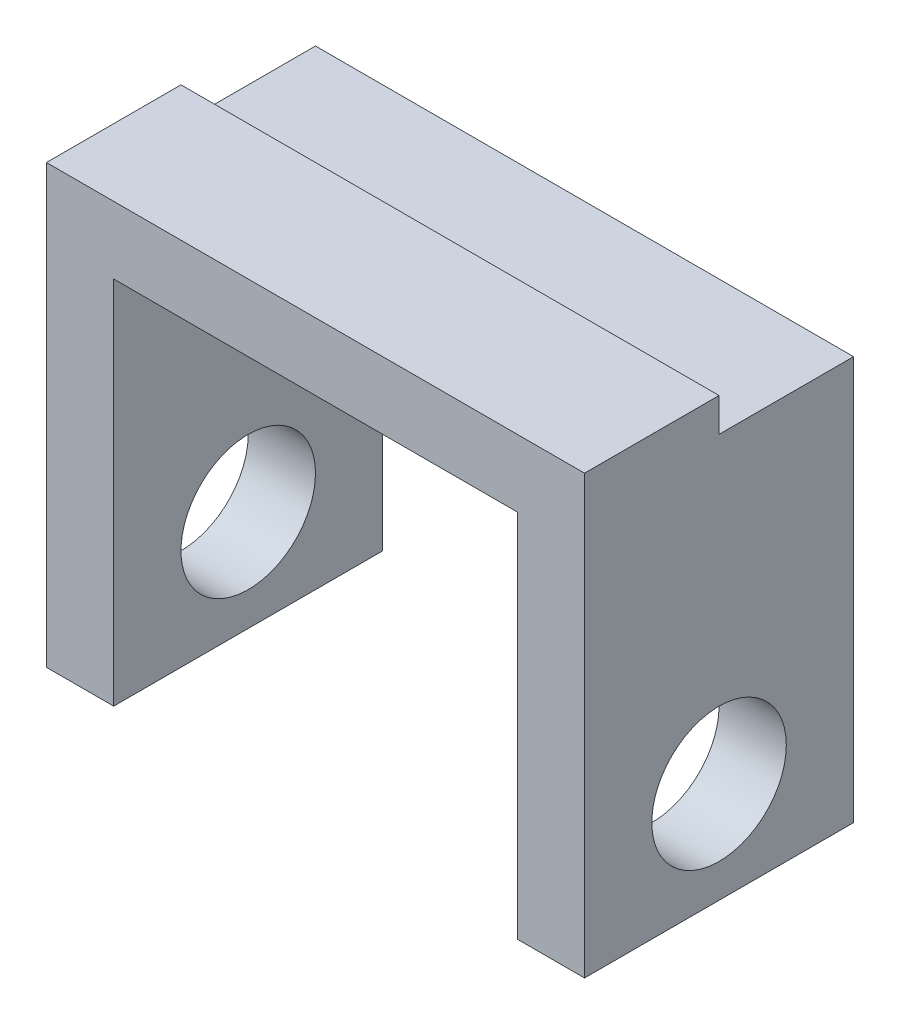
ISO-10303-21;
HEADER;
FILE_DESCRIPTION(('STEP AP214'),'2;1');
FILE_NAME('part.step','',(''),(''),'','','');
FILE_SCHEMA(('AUTOMOTIVE_DESIGN { 1 0 10303 214 1 1 1 1 }'));
ENDSEC;
DATA;
#1=APPLICATION_CONTEXT('core data for automotive mechanical design processes');
#2=APPLICATION_PROTOCOL_DEFINITION('international standard','automotive_design',2000,#1);
#3=PRODUCT_CONTEXT('',#1,'mechanical');
#4=PRODUCT('Part','Part','',(#3));
#5=PRODUCT_RELATED_PRODUCT_CATEGORY('part','',(#4));
#6=PRODUCT_DEFINITION_FORMATION('','',#4);
#7=PRODUCT_DEFINITION_CONTEXT('part definition',#1,'design');
#8=PRODUCT_DEFINITION('design','',#6,#7);
#9=PRODUCT_DEFINITION_SHAPE('','',#8);
#10=(LENGTH_UNIT() NAMED_UNIT(*) SI_UNIT(.MILLI.,.METRE.));
#11=(NAMED_UNIT(*) PLANE_ANGLE_UNIT() SI_UNIT($,.RADIAN.));
#12=(NAMED_UNIT(*) SI_UNIT($,.STERADIAN.) SOLID_ANGLE_UNIT());
#13=UNCERTAINTY_MEASURE_WITH_UNIT(LENGTH_MEASURE(1.E-05),#10,'distance_accuracy_value','');
#14=(GEOMETRIC_REPRESENTATION_CONTEXT(3) GLOBAL_UNCERTAINTY_ASSIGNED_CONTEXT((#13)) GLOBAL_UNIT_ASSIGNED_CONTEXT((#10,
#11,#12)) REPRESENTATION_CONTEXT('',''));
#15=CARTESIAN_POINT('',(0.,0.,0.));
#16=DIRECTION('',(0.,0.,1.));
#17=DIRECTION('',(1.,0.,0.));
#18=AXIS2_PLACEMENT_3D('',#15,#16,#17);
#19=CARTESIAN_POINT('',(40.,50.,20.));
#20=DIRECTION('',(0.,0.,-1.));
#21=DIRECTION('',(0.,1.,0.));
#22=AXIS2_PLACEMENT_3D('',#19,#20,#21);
#23=PLANE('',#22);
#24=DIRECTION('',(0.,1.,0.));
#25=VECTOR('',#24,1.);
#26=CARTESIAN_POINT('',(-30.,-15.,20.));
#27=LINE('',#26,#25);
#28=CARTESIAN_POINT('',(-30.,-15.,20.));
#29=VERTEX_POINT('',#28);
#30=CARTESIAN_POINT('',(-30.,40.,20.));
#31=VERTEX_POINT('',#30);
#32=EDGE_CURVE('E137',#29,#31,#27,.T.);
#33=ORIENTED_EDGE('',*,*,#32,.T.);
#34=DIRECTION('',(1.,0.,0.));
#35=VECTOR('',#34,1.);
#36=CARTESIAN_POINT('',(-30.,40.,20.));
#37=LINE('',#36,#35);
#38=CARTESIAN_POINT('',(30.,40.,20.));
#39=VERTEX_POINT('',#38);
#40=EDGE_CURVE('E141',#31,#39,#37,.T.);
#41=ORIENTED_EDGE('',*,*,#40,.T.);
#42=DIRECTION('',(0.,1.,0.));
#43=VECTOR('',#42,1.);
#44=CARTESIAN_POINT('',(30.,-15.,20.));
#45=LINE('',#44,#43);
#46=CARTESIAN_POINT('',(30.,-15.,20.));
#47=VERTEX_POINT('',#46);
#48=EDGE_CURVE('E144',#47,#39,#45,.T.);
#49=ORIENTED_EDGE('',*,*,#48,.F.);
#50=DIRECTION('',(-1.,0.,0.));
#51=VECTOR('',#50,1.);
#52=CARTESIAN_POINT('',(40.,-15.,20.));
#53=LINE('',#52,#51);
#54=CARTESIAN_POINT('',(40.,-15.,20.));
#55=VERTEX_POINT('',#54);
#56=EDGE_CURVE('E11',#55,#47,#53,.T.);
#57=ORIENTED_EDGE('',*,*,#56,.F.);
#58=DIRECTION('',(0.,-1.,0.));
#59=VECTOR('',#58,1.);
#60=CARTESIAN_POINT('',(40.,50.,20.));
#61=LINE('',#60,#59);
#62=CARTESIAN_POINT('',(40.,50.,20.));
#63=VERTEX_POINT('',#62);
#64=EDGE_CURVE('E169',#63,#55,#61,.T.);
#65=ORIENTED_EDGE('',*,*,#64,.F.);
#66=DIRECTION('',(-1.,0.,0.));
#67=VECTOR('',#66,1.);
#68=CARTESIAN_POINT('',(40.,50.,20.));
#69=LINE('',#68,#67);
#70=CARTESIAN_POINT('',(-40.,50.,20.));
#71=VERTEX_POINT('',#70);
#72=EDGE_CURVE('E178',#63,#71,#69,.T.);
#73=ORIENTED_EDGE('',*,*,#72,.T.);
#74=DIRECTION('',(0.,-1.,0.));
#75=VECTOR('',#74,1.);
#76=CARTESIAN_POINT('',(-40.,50.,20.));
#77=LINE('',#76,#75);
#78=CARTESIAN_POINT('',(-40.,-15.,20.));
#79=VERTEX_POINT('',#78);
#80=EDGE_CURVE('E165',#71,#79,#77,.T.);
#81=ORIENTED_EDGE('',*,*,#80,.T.);
#82=EDGE_CURVE('E41',#29,#79,#53,.T.);
#83=ORIENTED_EDGE('',*,*,#82,.F.);
#84=EDGE_LOOP('',(#33,#41,#49,#57,#65,#73,#81,#83));
#85=FACE_BOUND('',#84,.T.);
#86=ADVANCED_FACE('F33',(#85),#23,.F.);
#87=CARTESIAN_POINT('',(40.,-15.,20.));
#88=DIRECTION('',(0.,1.,0.));
#89=DIRECTION('',(0.,0.,1.));
#90=AXIS2_PLACEMENT_3D('',#87,#88,#89);
#91=PLANE('',#90);
#92=DIRECTION('',(0.,0.,1.));
#93=VECTOR('',#92,1.);
#94=CARTESIAN_POINT('',(-30.,-15.,-20.));
#95=LINE('',#94,#93);
#96=CARTESIAN_POINT('',(-30.,-15.,-20.));
#97=VERTEX_POINT('',#96);
#98=EDGE_CURVE('E153',#97,#29,#95,.T.);
#99=ORIENTED_EDGE('',*,*,#98,.T.);
#100=ORIENTED_EDGE('',*,*,#82,.T.);
#101=DIRECTION('',(0.,0.,-1.));
#102=VECTOR('',#101,1.);
#103=CARTESIAN_POINT('',(-40.,-15.,20.));
#104=LINE('',#103,#102);
#105=CARTESIAN_POINT('',(-40.,-15.,-20.));
#106=VERTEX_POINT('',#105);
#107=EDGE_CURVE('E181',#79,#106,#104,.T.);
#108=ORIENTED_EDGE('',*,*,#107,.T.);
#109=DIRECTION('',(-1.,0.,0.));
#110=VECTOR('',#109,1.);
#111=CARTESIAN_POINT('',(40.,-15.,-20.));
#112=LINE('',#111,#110);
#113=EDGE_CURVE('E190',#97,#106,#112,.T.);
#114=ORIENTED_EDGE('',*,*,#113,.F.);
#115=EDGE_LOOP('',(#99,#100,#108,#114));
#116=FACE_BOUND('',#115,.T.);
#117=ADVANCED_FACE('F215',(#116),#91,.F.);
#118=CARTESIAN_POINT('',(40.,50.,-20.));
#119=DIRECTION('',(0.,0.,1.));
#120=DIRECTION('',(0.,-1.,0.));
#121=AXIS2_PLACEMENT_3D('',#118,#119,#120);
#122=PLANE('',#121);
#123=DIRECTION('',(0.,1.,0.));
#124=VECTOR('',#123,1.);
#125=CARTESIAN_POINT('',(-40.,50.,-20.));
#126=LINE('',#125,#124);
#127=CARTESIAN_POINT('',(-40.,45.,-20.));
#128=VERTEX_POINT('',#127);
#129=EDGE_CURVE('E184',#106,#128,#126,.T.);
#130=ORIENTED_EDGE('',*,*,#129,.T.);
#131=DIRECTION('',(1.,0.,0.));
#132=VECTOR('',#131,1.);
#133=CARTESIAN_POINT('',(-40.,45.,-20.));
#134=LINE('',#133,#132);
#135=CARTESIAN_POINT('',(40.,45.,-20.));
#136=VERTEX_POINT('',#135);
#137=EDGE_CURVE('E118',#128,#136,#134,.T.);
#138=ORIENTED_EDGE('',*,*,#137,.T.);
#139=DIRECTION('',(0.,1.,0.));
#140=VECTOR('',#139,1.);
#141=CARTESIAN_POINT('',(40.,50.,-20.));
#142=LINE('',#141,#140);
#143=CARTESIAN_POINT('',(40.,-15.,-20.));
#144=VERTEX_POINT('',#143);
#145=EDGE_CURVE('E131',#144,#136,#142,.T.);
#146=ORIENTED_EDGE('',*,*,#145,.F.);
#147=CARTESIAN_POINT('',(30.,-15.,-20.));
#148=VERTEX_POINT('',#147);
#149=EDGE_CURVE('E191',#144,#148,#112,.T.);
#150=ORIENTED_EDGE('',*,*,#149,.T.);
#151=DIRECTION('',(0.,1.,0.));
#152=VECTOR('',#151,1.);
#153=CARTESIAN_POINT('',(30.,-15.,-20.));
#154=LINE('',#153,#152);
#155=CARTESIAN_POINT('',(30.,40.,-20.));
#156=VERTEX_POINT('',#155);
#157=EDGE_CURVE('E150',#148,#156,#154,.T.);
#158=ORIENTED_EDGE('',*,*,#157,.T.);
#159=DIRECTION('',(1.,0.,0.));
#160=VECTOR('',#159,1.);
#161=CARTESIAN_POINT('',(-30.,40.,-20.));
#162=LINE('',#161,#160);
#163=CARTESIAN_POINT('',(-30.,40.,-20.));
#164=VERTEX_POINT('',#163);
#165=EDGE_CURVE('E148',#164,#156,#162,.T.);
#166=ORIENTED_EDGE('',*,*,#165,.F.);
#167=DIRECTION('',(0.,1.,0.));
#168=VECTOR('',#167,1.);
#169=CARTESIAN_POINT('',(-30.,-15.,-20.));
#170=LINE('',#169,#168);
#171=EDGE_CURVE('E146',#97,#164,#170,.T.);
#172=ORIENTED_EDGE('',*,*,#171,.F.);
#173=ORIENTED_EDGE('',*,*,#113,.T.);
#174=EDGE_LOOP('',(#130,#138,#146,#150,#158,#166,#172,#173));
#175=FACE_BOUND('',#174,.T.);
#176=ADVANCED_FACE('F214',(#175),#122,.F.);
#177=CARTESIAN_POINT('',(40.,0.,0.));
#178=DIRECTION('',(-1.,0.,0.));
#179=DIRECTION('',(0.,0.,1.));
#180=AXIS2_PLACEMENT_3D('',#177,#178,#179);
#181=CYLINDRICAL_SURFACE('',#180,10.);
#182=CARTESIAN_POINT('',(-40.,0.,0.));
#183=DIRECTION('',(1.,0.,0.));
#184=DIRECTION('',(0.,0.,-1.));
#185=AXIS2_PLACEMENT_3D('',#182,#183,#184);
#186=CIRCLE('',#185,10.);
#187=CARTESIAN_POINT('',(-40.,0.,-10.));
#188=VERTEX_POINT('',#187);
#189=EDGE_CURVE('E166',#188,#188,#186,.T.);
#190=ORIENTED_EDGE('',*,*,#189,.F.);
#191=EDGE_LOOP('',(#190));
#192=FACE_BOUND('',#191,.T.);
#193=CARTESIAN_POINT('',(-30.,0.,0.));
#194=DIRECTION('',(1.,0.,0.));
#195=DIRECTION('',(0.,0.,-1.));
#196=AXIS2_PLACEMENT_3D('',#193,#194,#195);
#197=CIRCLE('',#196,10.);
#198=CARTESIAN_POINT('',(-30.,0.,-10.));
#199=VERTEX_POINT('',#198);
#200=EDGE_CURVE('E36',#199,#199,#197,.T.);
#201=ORIENTED_EDGE('',*,*,#200,.T.);
#202=EDGE_LOOP('',(#201));
#203=FACE_BOUND('',#202,.T.);
#204=ADVANCED_FACE('F199',(#192,#203),#181,.F.);
#205=CARTESIAN_POINT('',(40.,0.,0.));
#206=DIRECTION('',(1.,0.,0.));
#207=DIRECTION('',(0.,0.,-1.));
#208=AXIS2_PLACEMENT_3D('',#205,#206,#207);
#209=PLANE('',#208);
#210=DIRECTION('',(0.,-1.,0.));
#211=VECTOR('',#210,1.);
#212=CARTESIAN_POINT('',(40.,50.,0.));
#213=LINE('',#212,#211);
#214=CARTESIAN_POINT('',(40.,50.,0.));
#215=VERTEX_POINT('',#214);
#216=CARTESIAN_POINT('',(40.,45.,0.));
#217=VERTEX_POINT('',#216);
#218=EDGE_CURVE('E121',#215,#217,#213,.T.);
#219=ORIENTED_EDGE('',*,*,#218,.F.);
#220=DIRECTION('',(0.,0.,1.));
#221=VECTOR('',#220,1.);
#222=CARTESIAN_POINT('',(40.,50.,20.));
#223=LINE('',#222,#221);
#224=EDGE_CURVE('E176',#215,#63,#223,.T.);
#225=ORIENTED_EDGE('',*,*,#224,.T.);
#226=ORIENTED_EDGE('',*,*,#64,.T.);
#227=DIRECTION('',(0.,0.,-1.));
#228=VECTOR('',#227,1.);
#229=CARTESIAN_POINT('',(40.,-15.,20.));
#230=LINE('',#229,#228);
#231=EDGE_CURVE('E172',#55,#144,#230,.T.);
#232=ORIENTED_EDGE('',*,*,#231,.T.);
#233=ORIENTED_EDGE('',*,*,#145,.T.);
#234=DIRECTION('',(0.,0.,-1.));
#235=VECTOR('',#234,1.);
#236=CARTESIAN_POINT('',(40.,45.,0.));
#237=LINE('',#236,#235);
#238=EDGE_CURVE('E114',#217,#136,#237,.T.);
#239=ORIENTED_EDGE('',*,*,#238,.F.);
#240=EDGE_LOOP('',(#219,#225,#226,#232,#233,#239));
#241=FACE_BOUND('',#240,.T.);
#242=CARTESIAN_POINT('',(40.,0.,0.));
#243=DIRECTION('',(1.,0.,0.));
#244=DIRECTION('',(0.,0.,-1.));
#245=AXIS2_PLACEMENT_3D('',#242,#243,#244);
#246=CIRCLE('',#245,10.);
#247=CARTESIAN_POINT('',(40.,0.,-10.));
#248=VERTEX_POINT('',#247);
#249=EDGE_CURVE('E162',#248,#248,#246,.T.);
#250=ORIENTED_EDGE('',*,*,#249,.F.);
#251=EDGE_LOOP('',(#250));
#252=FACE_BOUND('',#251,.T.);
#253=ADVANCED_FACE('F128',(#241,#252),#209,.T.);
#254=CARTESIAN_POINT('',(-40.,0.,0.));
#255=DIRECTION('',(1.,0.,0.));
#256=DIRECTION('',(0.,0.,-1.));
#257=AXIS2_PLACEMENT_3D('',#254,#255,#256);
#258=PLANE('',#257);
#259=DIRECTION('',(0.,0.,1.));
#260=VECTOR('',#259,1.);
#261=CARTESIAN_POINT('',(-40.,50.,20.));
#262=LINE('',#261,#260);
#263=CARTESIAN_POINT('',(-40.,50.,0.));
#264=VERTEX_POINT('',#263);
#265=EDGE_CURVE('E173',#264,#71,#262,.T.);
#266=ORIENTED_EDGE('',*,*,#265,.F.);
#267=DIRECTION('',(0.,-1.,0.));
#268=VECTOR('',#267,1.);
#269=CARTESIAN_POINT('',(-40.,50.,0.));
#270=LINE('',#269,#268);
#271=CARTESIAN_POINT('',(-40.,45.,0.));
#272=VERTEX_POINT('',#271);
#273=EDGE_CURVE('E49',#264,#272,#270,.T.);
#274=ORIENTED_EDGE('',*,*,#273,.T.);
#275=DIRECTION('',(0.,0.,-1.));
#276=VECTOR('',#275,1.);
#277=CARTESIAN_POINT('',(-40.,45.,0.));
#278=LINE('',#277,#276);
#279=EDGE_CURVE('E117',#272,#128,#278,.T.);
#280=ORIENTED_EDGE('',*,*,#279,.T.);
#281=ORIENTED_EDGE('',*,*,#129,.F.);
#282=ORIENTED_EDGE('',*,*,#107,.F.);
#283=ORIENTED_EDGE('',*,*,#80,.F.);
#284=EDGE_LOOP('',(#266,#274,#280,#281,#282,#283));
#285=FACE_BOUND('',#284,.T.);
#286=ORIENTED_EDGE('',*,*,#189,.T.);
#287=EDGE_LOOP('',(#286));
#288=FACE_BOUND('',#287,.T.);
#289=ADVANCED_FACE('F221',(#285,#288),#258,.F.);
#290=ORIENTED_EDGE('',*,*,#56,.T.);
#291=DIRECTION('',(0.,0.,1.));
#292=VECTOR('',#291,1.);
#293=CARTESIAN_POINT('',(30.,-15.,-20.));
#294=LINE('',#293,#292);
#295=EDGE_CURVE('E156',#148,#47,#294,.T.);
#296=ORIENTED_EDGE('',*,*,#295,.F.);
#297=ORIENTED_EDGE('',*,*,#149,.F.);
#298=ORIENTED_EDGE('',*,*,#231,.F.);
#299=EDGE_LOOP('',(#290,#296,#297,#298));
#300=FACE_BOUND('',#299,.T.);
#301=ADVANCED_FACE('F226',(#300),#91,.F.);
#302=CARTESIAN_POINT('',(40.,50.,20.));
#303=DIRECTION('',(0.,-1.,0.));
#304=DIRECTION('',(0.,0.,-1.));
#305=AXIS2_PLACEMENT_3D('',#302,#303,#304);
#306=PLANE('',#305);
#307=ORIENTED_EDGE('',*,*,#224,.F.);
#308=DIRECTION('',(1.,0.,0.));
#309=VECTOR('',#308,1.);
#310=CARTESIAN_POINT('',(-40.,50.,0.));
#311=LINE('',#310,#309);
#312=EDGE_CURVE('E123',#264,#215,#311,.T.);
#313=ORIENTED_EDGE('',*,*,#312,.F.);
#314=ORIENTED_EDGE('',*,*,#265,.T.);
#315=ORIENTED_EDGE('',*,*,#72,.F.);
#316=EDGE_LOOP('',(#307,#313,#314,#315));
#317=FACE_BOUND('',#316,.T.);
#318=ADVANCED_FACE('F249',(#317),#306,.F.);
#319=CARTESIAN_POINT('',(30.,0.,0.));
#320=DIRECTION('',(1.,0.,0.));
#321=DIRECTION('',(0.,0.,-1.));
#322=AXIS2_PLACEMENT_3D('',#319,#320,#321);
#323=CIRCLE('',#322,10.);
#324=CARTESIAN_POINT('',(30.,0.,-10.));
#325=VERTEX_POINT('',#324);
#326=EDGE_CURVE('E161',#325,#325,#323,.T.);
#327=ORIENTED_EDGE('',*,*,#326,.F.);
#328=EDGE_LOOP('',(#327));
#329=FACE_BOUND('',#328,.T.);
#330=ORIENTED_EDGE('',*,*,#249,.T.);
#331=EDGE_LOOP('',(#330));
#332=FACE_BOUND('',#331,.T.);
#333=ADVANCED_FACE('F205',(#329,#332),#181,.F.);
#334=CARTESIAN_POINT('',(-30.,-15.,-20.));
#335=DIRECTION('',(1.,0.,0.));
#336=DIRECTION('',(0.,0.,-1.));
#337=AXIS2_PLACEMENT_3D('',#334,#335,#336);
#338=PLANE('',#337);
#339=ORIENTED_EDGE('',*,*,#200,.F.);
#340=EDGE_LOOP('',(#339));
#341=FACE_BOUND('',#340,.T.);
#342=ORIENTED_EDGE('',*,*,#98,.F.);
#343=ORIENTED_EDGE('',*,*,#171,.T.);
#344=DIRECTION('',(0.,0.,1.));
#345=VECTOR('',#344,1.);
#346=CARTESIAN_POINT('',(-30.,40.,-20.));
#347=LINE('',#346,#345);
#348=EDGE_CURVE('E159',#164,#31,#347,.T.);
#349=ORIENTED_EDGE('',*,*,#348,.T.);
#350=ORIENTED_EDGE('',*,*,#32,.F.);
#351=EDGE_LOOP('',(#342,#343,#349,#350));
#352=FACE_BOUND('',#351,.T.);
#353=ADVANCED_FACE('F201',(#341,#352),#338,.T.);
#354=CARTESIAN_POINT('',(-30.,40.,-20.));
#355=DIRECTION('',(0.,-1.,0.));
#356=DIRECTION('',(0.,0.,-1.));
#357=AXIS2_PLACEMENT_3D('',#354,#355,#356);
#358=PLANE('',#357);
#359=ORIENTED_EDGE('',*,*,#348,.F.);
#360=ORIENTED_EDGE('',*,*,#165,.T.);
#361=DIRECTION('',(0.,0.,1.));
#362=VECTOR('',#361,1.);
#363=CARTESIAN_POINT('',(30.,40.,-20.));
#364=LINE('',#363,#362);
#365=EDGE_CURVE('E57',#156,#39,#364,.T.);
#366=ORIENTED_EDGE('',*,*,#365,.T.);
#367=ORIENTED_EDGE('',*,*,#40,.F.);
#368=EDGE_LOOP('',(#359,#360,#366,#367));
#369=FACE_BOUND('',#368,.T.);
#370=ADVANCED_FACE('F204',(#369),#358,.T.);
#371=CARTESIAN_POINT('',(30.,-15.,-20.));
#372=DIRECTION('',(1.,0.,0.));
#373=DIRECTION('',(0.,0.,-1.));
#374=AXIS2_PLACEMENT_3D('',#371,#372,#373);
#375=PLANE('',#374);
#376=ORIENTED_EDGE('',*,*,#326,.T.);
#377=EDGE_LOOP('',(#376));
#378=FACE_BOUND('',#377,.T.);
#379=ORIENTED_EDGE('',*,*,#365,.F.);
#380=ORIENTED_EDGE('',*,*,#157,.F.);
#381=ORIENTED_EDGE('',*,*,#295,.T.);
#382=ORIENTED_EDGE('',*,*,#48,.T.);
#383=EDGE_LOOP('',(#379,#380,#381,#382));
#384=FACE_BOUND('',#383,.T.);
#385=ADVANCED_FACE('F229',(#378,#384),#375,.F.);
#386=CARTESIAN_POINT('',(-40.,50.,0.));
#387=DIRECTION('',(0.,0.,1.));
#388=DIRECTION('',(0.,-1.,0.));
#389=AXIS2_PLACEMENT_3D('',#386,#387,#388);
#390=PLANE('',#389);
#391=DIRECTION('',(1.,0.,0.));
#392=VECTOR('',#391,1.);
#393=CARTESIAN_POINT('',(-40.,45.,0.));
#394=LINE('',#393,#392);
#395=EDGE_CURVE('E110',#272,#217,#394,.T.);
#396=ORIENTED_EDGE('',*,*,#395,.F.);
#397=ORIENTED_EDGE('',*,*,#273,.F.);
#398=ORIENTED_EDGE('',*,*,#312,.T.);
#399=ORIENTED_EDGE('',*,*,#218,.T.);
#400=EDGE_LOOP('',(#396,#397,#398,#399));
#401=FACE_BOUND('',#400,.T.);
#402=ADVANCED_FACE('F122',(#401),#390,.F.);
#403=CARTESIAN_POINT('',(-40.,45.,0.));
#404=DIRECTION('',(0.,-1.,0.));
#405=DIRECTION('',(0.,0.,-1.));
#406=AXIS2_PLACEMENT_3D('',#403,#404,#405);
#407=PLANE('',#406);
#408=ORIENTED_EDGE('',*,*,#137,.F.);
#409=ORIENTED_EDGE('',*,*,#279,.F.);
#410=ORIENTED_EDGE('',*,*,#395,.T.);
#411=ORIENTED_EDGE('',*,*,#238,.T.);
#412=EDGE_LOOP('',(#408,#409,#410,#411));
#413=FACE_BOUND('',#412,.T.);
#414=ADVANCED_FACE('F112',(#413),#407,.F.);
#415=CLOSED_SHELL('',(#86,#117,#176,#204,#253,#289,#301,#318,#333,#353,#370,#385,#402,#414));
#416=MANIFOLD_SOLID_BREP('B2',#415);
#417=ADVANCED_BREP_SHAPE_REPRESENTATION('',(#18,#416),#14);
#418=SHAPE_DEFINITION_REPRESENTATION(#9,#417);
ENDSEC;
END-ISO-10303-21;
